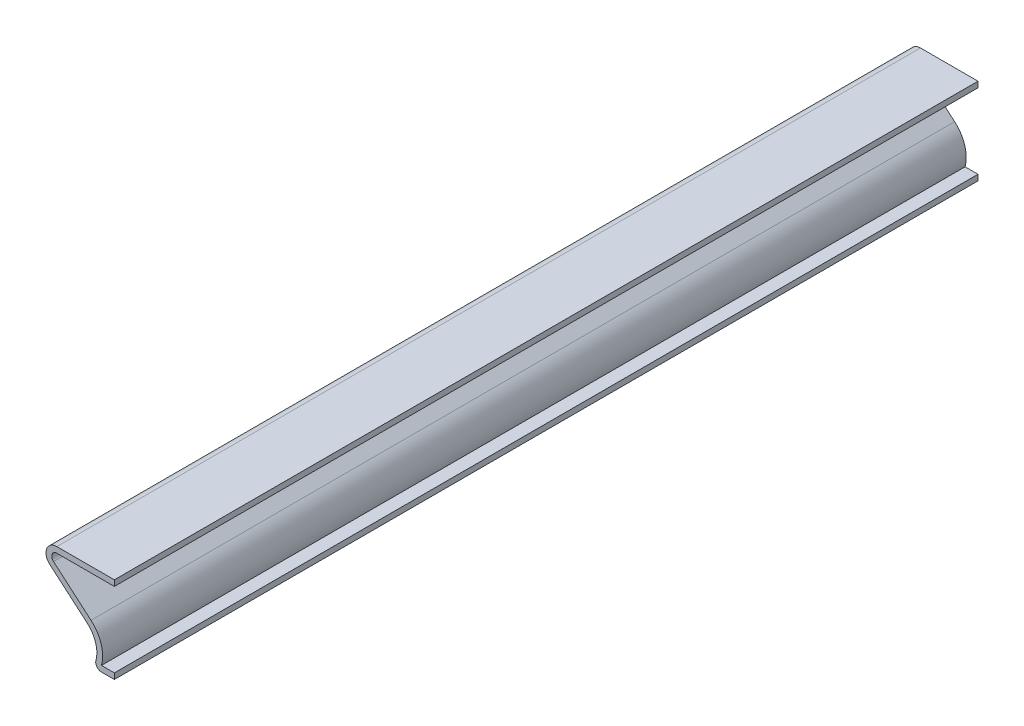
ISO-10303-21;
HEADER;
FILE_DESCRIPTION(('STEP AP214'),'2;1');
FILE_NAME('part.step','',(''),(''),'','','');
FILE_SCHEMA(('AUTOMOTIVE_DESIGN { 1 0 10303 214 1 1 1 1 }'));
ENDSEC;
DATA;
#1=APPLICATION_CONTEXT('core data for automotive mechanical design processes');
#2=APPLICATION_PROTOCOL_DEFINITION('international standard','automotive_design',2000,#1);
#3=PRODUCT_CONTEXT('',#1,'mechanical');
#4=PRODUCT('Part','Part','',(#3));
#5=PRODUCT_RELATED_PRODUCT_CATEGORY('part','',(#4));
#6=PRODUCT_DEFINITION_FORMATION('','',#4);
#7=PRODUCT_DEFINITION_CONTEXT('part definition',#1,'design');
#8=PRODUCT_DEFINITION('design','',#6,#7);
#9=PRODUCT_DEFINITION_SHAPE('','',#8);
#10=(LENGTH_UNIT() NAMED_UNIT(*) SI_UNIT(.MILLI.,.METRE.));
#11=(NAMED_UNIT(*) PLANE_ANGLE_UNIT() SI_UNIT($,.RADIAN.));
#12=(NAMED_UNIT(*) SI_UNIT($,.STERADIAN.) SOLID_ANGLE_UNIT());
#13=UNCERTAINTY_MEASURE_WITH_UNIT(LENGTH_MEASURE(1.E-05),#10,'distance_accuracy_value','');
#14=(GEOMETRIC_REPRESENTATION_CONTEXT(3) GLOBAL_UNCERTAINTY_ASSIGNED_CONTEXT((#13)) GLOBAL_UNIT_ASSIGNED_CONTEXT((#10,
#11,#12)) REPRESENTATION_CONTEXT('',''));
#15=CARTESIAN_POINT('',(0.,0.,0.));
#16=DIRECTION('',(0.,0.,1.));
#17=DIRECTION('',(1.,0.,0.));
#18=AXIS2_PLACEMENT_3D('',#15,#16,#17);
#19=CARTESIAN_POINT('',(-4.7625,0.,-190.5));
#20=DIRECTION('',(0.,-1.,0.));
#21=DIRECTION('',(0.,0.,-1.));
#22=AXIS2_PLACEMENT_3D('',#19,#20,#21);
#23=PLANE('',#22);
#24=DIRECTION('',(1.,0.,0.));
#25=VECTOR('',#24,1.);
#26=CARTESIAN_POINT('',(-4.7625,0.,0.));
#27=LINE('',#26,#25);
#28=CARTESIAN_POINT('',(-2.8457845091729,0.,0.));
#29=VERTEX_POINT('',#28);
#30=CARTESIAN_POINT('',(0.,0.,0.));
#31=VERTEX_POINT('',#30);
#32=EDGE_CURVE('E204',#29,#31,#27,.T.);
#33=ORIENTED_EDGE('',*,*,#32,.F.);
#34=DIRECTION('',(0.,0.,1.));
#35=VECTOR('',#34,1.);
#36=CARTESIAN_POINT('',(-2.8457845091729,0.,-190.5));
#37=LINE('',#36,#35);
#38=CARTESIAN_POINT('',(-2.8457845091729,0.,-190.5));
#39=VERTEX_POINT('',#38);
#40=EDGE_CURVE('E43',#29,#39,#37,.F.);
#41=ORIENTED_EDGE('',*,*,#40,.T.);
#42=DIRECTION('',(1.,0.,0.));
#43=VECTOR('',#42,1.);
#44=CARTESIAN_POINT('',(-4.7625,0.,-190.5));
#45=LINE('',#44,#43);
#46=CARTESIAN_POINT('',(0.,0.,-190.5));
#47=VERTEX_POINT('',#46);
#48=EDGE_CURVE('E126',#39,#47,#45,.T.);
#49=ORIENTED_EDGE('',*,*,#48,.T.);
#50=DIRECTION('',(0.,0.,1.));
#51=VECTOR('',#50,1.);
#52=CARTESIAN_POINT('',(0.,0.,-190.5));
#53=LINE('',#52,#51);
#54=EDGE_CURVE('E129',#47,#31,#53,.T.);
#55=ORIENTED_EDGE('',*,*,#54,.T.);
#56=EDGE_LOOP('',(#33,#41,#49,#55));
#57=FACE_BOUND('',#56,.T.);
#58=ADVANCED_FACE('F35',(#57),#23,.T.);
#59=CARTESIAN_POINT('',(-9.921875,3.175,-190.5));
#60=DIRECTION('',(0.,0.,1.));
#61=DIRECTION('',(1.,0.,0.));
#62=AXIS2_PLACEMENT_3D('',#59,#60,#61);
#63=CYLINDRICAL_SURFACE('',#62,6.05803395423177);
#64=CARTESIAN_POINT('',(-9.921875,3.175,-190.5));
#65=DIRECTION('',(0.,0.,-1.));
#66=DIRECTION('',(-1.,0.,0.));
#67=AXIS2_PLACEMENT_3D('',#64,#65,#66);
#68=CIRCLE('',#67,6.05803395423177);
#69=CARTESIAN_POINT('',(-5.9802225500164,7.77534252574341,-190.5));
#70=VERTEX_POINT('',#69);
#71=CARTESIAN_POINT('',(-4.0721209289381,1.60014994405189,-190.5));
#72=VERTEX_POINT('',#71);
#73=EDGE_CURVE('E148',#70,#72,#68,.T.);
#74=ORIENTED_EDGE('',*,*,#73,.T.);
#75=DIRECTION('',(0.,0.,1.));
#76=VECTOR('',#75,1.);
#77=CARTESIAN_POINT('',(-4.0721209289381,1.60014994405189,-190.5));
#78=LINE('',#77,#76);
#79=CARTESIAN_POINT('',(-4.0721209289381,1.60014994405189,0.));
#80=VERTEX_POINT('',#79);
#81=EDGE_CURVE('E157',#72,#80,#78,.T.);
#82=ORIENTED_EDGE('',*,*,#81,.T.);
#83=CARTESIAN_POINT('',(-9.921875,3.175,0.));
#84=DIRECTION('',(0.,0.,-1.));
#85=DIRECTION('',(-1.,0.,0.));
#86=AXIS2_PLACEMENT_3D('',#83,#84,#85);
#87=CIRCLE('',#86,6.05803395423177);
#88=CARTESIAN_POINT('',(-5.9802225500164,7.77534252574341,0.));
#89=VERTEX_POINT('',#88);
#90=EDGE_CURVE('E134',#89,#80,#87,.T.);
#91=ORIENTED_EDGE('',*,*,#90,.F.);
#92=DIRECTION('',(0.,0.,1.));
#93=VECTOR('',#92,1.);
#94=CARTESIAN_POINT('',(-5.9802225500164,7.77534252574341,-190.5));
#95=LINE('',#94,#93);
#96=EDGE_CURVE('E160',#70,#89,#95,.T.);
#97=ORIENTED_EDGE('',*,*,#96,.F.);
#98=EDGE_LOOP('',(#74,#82,#91,#97));
#99=FACE_BOUND('',#98,.T.);
#100=ADVANCED_FACE('F221',(#99),#63,.F.);
#101=CARTESIAN_POINT('',(-14.2493574264249,14.8604792438128,-190.5));
#102=DIRECTION('',(-0.650648787999976,-0.759378795249224,0.));
#103=DIRECTION('',(0.759378795249224,-0.650648787999976,0.));
#104=AXIS2_PLACEMENT_3D('',#101,#102,#103);
#105=PLANE('',#104);
#106=DIRECTION('',(0.759378795249224,-0.650648787999976,0.));
#107=VECTOR('',#106,1.);
#108=CARTESIAN_POINT('',(-14.2493574264249,14.8604792438128,0.));
#109=LINE('',#108,#107);
#110=CARTESIAN_POINT('',(-14.2493574264249,14.8604792438128,0.));
#111=VERTEX_POINT('',#110);
#112=EDGE_CURVE('E220',#111,#89,#109,.T.);
#113=ORIENTED_EDGE('',*,*,#112,.F.);
#114=DIRECTION('',(0.,0.,1.));
#115=VECTOR('',#114,1.);
#116=CARTESIAN_POINT('',(-14.2493574264249,14.8604792438128,-190.5));
#117=LINE('',#116,#115);
#118=CARTESIAN_POINT('',(-14.2493574264249,14.8604792438128,-190.5));
#119=VERTEX_POINT('',#118);
#120=EDGE_CURVE('E164',#119,#111,#117,.T.);
#121=ORIENTED_EDGE('',*,*,#120,.F.);
#122=DIRECTION('',(0.759378795249224,-0.650648787999976,0.));
#123=VECTOR('',#122,1.);
#124=CARTESIAN_POINT('',(-14.2493574264249,14.8604792438128,-190.5));
#125=LINE('',#124,#123);
#126=EDGE_CURVE('E153',#119,#70,#125,.T.);
#127=ORIENTED_EDGE('',*,*,#126,.T.);
#128=ORIENTED_EDGE('',*,*,#96,.T.);
#129=EDGE_LOOP('',(#113,#121,#127,#128));
#130=FACE_BOUND('',#129,.T.);
#131=ADVANCED_FACE('F224',(#130),#105,.T.);
#132=CARTESIAN_POINT('',(-12.7,16.66875,-190.5));
#133=DIRECTION('',(0.,0.,1.));
#134=DIRECTION('',(1.,0.,0.));
#135=AXIS2_PLACEMENT_3D('',#132,#133,#134);
#136=CYLINDRICAL_SURFACE('',#135,2.38125);
#137=CARTESIAN_POINT('',(-12.7,16.66875,0.));
#138=DIRECTION('',(0.,0.,1.));
#139=DIRECTION('',(1.,0.,0.));
#140=AXIS2_PLACEMENT_3D('',#137,#138,#139);
#141=CIRCLE('',#140,2.38125);
#142=CARTESIAN_POINT('',(-12.7,19.05,0.));
#143=VERTEX_POINT('',#142);
#144=EDGE_CURVE('E218',#143,#111,#141,.T.);
#145=ORIENTED_EDGE('',*,*,#144,.F.);
#146=DIRECTION('',(0.,0.,1.));
#147=VECTOR('',#146,1.);
#148=CARTESIAN_POINT('',(-12.7,19.05,-190.5));
#149=LINE('',#148,#147);
#150=CARTESIAN_POINT('',(-12.7,19.05,-190.5));
#151=VERTEX_POINT('',#150);
#152=EDGE_CURVE('E170',#151,#143,#149,.T.);
#153=ORIENTED_EDGE('',*,*,#152,.F.);
#154=CARTESIAN_POINT('',(-12.7,16.66875,-190.5));
#155=DIRECTION('',(0.,0.,1.));
#156=DIRECTION('',(1.,0.,0.));
#157=AXIS2_PLACEMENT_3D('',#154,#155,#156);
#158=CIRCLE('',#157,2.38125);
#159=EDGE_CURVE('E227',#151,#119,#158,.T.);
#160=ORIENTED_EDGE('',*,*,#159,.T.);
#161=ORIENTED_EDGE('',*,*,#120,.T.);
#162=EDGE_LOOP('',(#145,#153,#160,#161));
#163=FACE_BOUND('',#162,.T.);
#164=ADVANCED_FACE('F267',(#163),#136,.T.);
#165=CARTESIAN_POINT('',(0.,19.05,-190.5));
#166=DIRECTION('',(0.,1.,0.));
#167=DIRECTION('',(-1.,0.,0.));
#168=AXIS2_PLACEMENT_3D('',#165,#166,#167);
#169=PLANE('',#168);
#170=DIRECTION('',(-1.,0.,0.));
#171=VECTOR('',#170,1.);
#172=CARTESIAN_POINT('',(0.,19.05,0.));
#173=LINE('',#172,#171);
#174=CARTESIAN_POINT('',(0.,19.05,0.));
#175=VERTEX_POINT('',#174);
#176=EDGE_CURVE('E215',#175,#143,#173,.T.);
#177=ORIENTED_EDGE('',*,*,#176,.F.);
#178=DIRECTION('',(0.,0.,1.));
#179=VECTOR('',#178,1.);
#180=CARTESIAN_POINT('',(0.,19.05,-190.5));
#181=LINE('',#180,#179);
#182=CARTESIAN_POINT('',(0.,19.05,-190.5));
#183=VERTEX_POINT('',#182);
#184=EDGE_CURVE('E176',#183,#175,#181,.T.);
#185=ORIENTED_EDGE('',*,*,#184,.F.);
#186=DIRECTION('',(-1.,0.,0.));
#187=VECTOR('',#186,1.);
#188=CARTESIAN_POINT('',(0.,19.05,-190.5));
#189=LINE('',#188,#187);
#190=EDGE_CURVE('E370',#183,#151,#189,.T.);
#191=ORIENTED_EDGE('',*,*,#190,.T.);
#192=ORIENTED_EDGE('',*,*,#152,.T.);
#193=EDGE_LOOP('',(#177,#185,#191,#192));
#194=FACE_BOUND('',#193,.T.);
#195=ADVANCED_FACE('F263',(#194),#169,.T.);
#196=CARTESIAN_POINT('',(0.,19.05,-190.5));
#197=DIRECTION('',(-1.,0.,0.));
#198=DIRECTION('',(0.,-1.,0.));
#199=AXIS2_PLACEMENT_3D('',#196,#197,#198);
#200=PLANE('',#199);
#201=DIRECTION('',(0.,-1.,0.));
#202=VECTOR('',#201,1.);
#203=CARTESIAN_POINT('',(0.,19.05,0.));
#204=LINE('',#203,#202);
#205=CARTESIAN_POINT('',(0.,17.78,0.));
#206=VERTEX_POINT('',#205);
#207=EDGE_CURVE('E213',#175,#206,#204,.T.);
#208=ORIENTED_EDGE('',*,*,#207,.T.);
#209=DIRECTION('',(0.,0.,1.));
#210=VECTOR('',#209,1.);
#211=CARTESIAN_POINT('',(0.,17.78,-190.5));
#212=LINE('',#211,#210);
#213=CARTESIAN_POINT('',(0.,17.78,-190.5));
#214=VERTEX_POINT('',#213);
#215=EDGE_CURVE('E178',#214,#206,#212,.T.);
#216=ORIENTED_EDGE('',*,*,#215,.F.);
#217=DIRECTION('',(0.,-1.,0.));
#218=VECTOR('',#217,1.);
#219=CARTESIAN_POINT('',(0.,19.05,-190.5));
#220=LINE('',#219,#218);
#221=EDGE_CURVE('E371',#183,#214,#220,.T.);
#222=ORIENTED_EDGE('',*,*,#221,.F.);
#223=ORIENTED_EDGE('',*,*,#184,.T.);
#224=EDGE_LOOP('',(#208,#216,#222,#223));
#225=FACE_BOUND('',#224,.T.);
#226=ADVANCED_FACE('F259',(#225),#200,.F.);
#227=CARTESIAN_POINT('',(0.,17.78,-190.5));
#228=DIRECTION('',(0.,1.,0.));
#229=DIRECTION('',(-1.,0.,0.));
#230=AXIS2_PLACEMENT_3D('',#227,#228,#229);
#231=PLANE('',#230);
#232=DIRECTION('',(-1.,0.,0.));
#233=VECTOR('',#232,1.);
#234=CARTESIAN_POINT('',(0.,17.78,0.));
#235=LINE('',#234,#233);
#236=CARTESIAN_POINT('',(-12.7,17.78,0.));
#237=VERTEX_POINT('',#236);
#238=EDGE_CURVE('E211',#206,#237,#235,.T.);
#239=ORIENTED_EDGE('',*,*,#238,.T.);
#240=DIRECTION('',(0.,0.,1.));
#241=VECTOR('',#240,1.);
#242=CARTESIAN_POINT('',(-12.7,17.78,-190.5));
#243=LINE('',#242,#241);
#244=CARTESIAN_POINT('',(-12.7,17.78,-190.5));
#245=VERTEX_POINT('',#244);
#246=EDGE_CURVE('E181',#245,#237,#243,.T.);
#247=ORIENTED_EDGE('',*,*,#246,.F.);
#248=DIRECTION('',(-1.,0.,0.));
#249=VECTOR('',#248,1.);
#250=CARTESIAN_POINT('',(0.,17.78,-190.5));
#251=LINE('',#250,#249);
#252=EDGE_CURVE('E374',#214,#245,#251,.T.);
#253=ORIENTED_EDGE('',*,*,#252,.F.);
#254=ORIENTED_EDGE('',*,*,#215,.T.);
#255=EDGE_LOOP('',(#239,#247,#253,#254));
#256=FACE_BOUND('',#255,.T.);
#257=ADVANCED_FACE('F255',(#256),#231,.F.);
#258=CARTESIAN_POINT('',(-12.7,16.66875,-190.5));
#259=DIRECTION('',(0.,0.,1.));
#260=DIRECTION('',(1.,0.,0.));
#261=AXIS2_PLACEMENT_3D('',#258,#259,#260);
#262=CYLINDRICAL_SURFACE('',#261,1.11125);
#263=CARTESIAN_POINT('',(-12.7,16.66875,0.));
#264=DIRECTION('',(0.,0.,1.));
#265=DIRECTION('',(1.,0.,0.));
#266=AXIS2_PLACEMENT_3D('',#263,#264,#265);
#267=CIRCLE('',#266,1.11125);
#268=CARTESIAN_POINT('',(-13.423033465665,15.8248903137793,0.));
#269=VERTEX_POINT('',#268);
#270=EDGE_CURVE('E209',#237,#269,#267,.T.);
#271=ORIENTED_EDGE('',*,*,#270,.T.);
#272=DIRECTION('',(0.,0.,1.));
#273=VECTOR('',#272,1.);
#274=CARTESIAN_POINT('',(-13.423033465665,15.8248903137793,-190.5));
#275=LINE('',#274,#273);
#276=CARTESIAN_POINT('',(-13.423033465665,15.8248903137793,-190.5));
#277=VERTEX_POINT('',#276);
#278=EDGE_CURVE('E184',#277,#269,#275,.T.);
#279=ORIENTED_EDGE('',*,*,#278,.F.);
#280=CARTESIAN_POINT('',(-12.7,16.66875,-190.5));
#281=DIRECTION('',(0.,0.,1.));
#282=DIRECTION('',(1.,0.,0.));
#283=AXIS2_PLACEMENT_3D('',#280,#281,#282);
#284=CIRCLE('',#283,1.11125);
#285=EDGE_CURVE('E378',#245,#277,#284,.T.);
#286=ORIENTED_EDGE('',*,*,#285,.F.);
#287=ORIENTED_EDGE('',*,*,#246,.T.);
#288=EDGE_LOOP('',(#271,#279,#286,#287));
#289=FACE_BOUND('',#288,.T.);
#290=ADVANCED_FACE('F251',(#289),#262,.F.);
#291=CARTESIAN_POINT('',(-13.423033465665,15.8248903137793,-190.5));
#292=DIRECTION('',(-0.650648787999976,-0.759378795249224,0.));
#293=DIRECTION('',(0.759378795249224,-0.650648787999976,0.));
#294=AXIS2_PLACEMENT_3D('',#291,#292,#293);
#295=PLANE('',#294);
#296=DIRECTION('',(0.759378795249224,-0.650648787999976,0.));
#297=VECTOR('',#296,1.);
#298=CARTESIAN_POINT('',(-13.423033465665,15.8248903137793,0.));
#299=LINE('',#298,#297);
#300=CARTESIAN_POINT('',(-5.15389858925643,8.73975359570993,0.));
#301=VERTEX_POINT('',#300);
#302=EDGE_CURVE('E202',#269,#301,#299,.T.);
#303=ORIENTED_EDGE('',*,*,#302,.T.);
#304=DIRECTION('',(0.,0.,1.));
#305=VECTOR('',#304,1.);
#306=CARTESIAN_POINT('',(-5.15389858925643,8.73975359570993,-190.5));
#307=LINE('',#306,#305);
#308=CARTESIAN_POINT('',(-5.15389858925643,8.73975359570993,-190.5));
#309=VERTEX_POINT('',#308);
#310=EDGE_CURVE('E187',#309,#301,#307,.T.);
#311=ORIENTED_EDGE('',*,*,#310,.F.);
#312=DIRECTION('',(0.759378795249224,-0.650648787999976,0.));
#313=VECTOR('',#312,1.);
#314=CARTESIAN_POINT('',(-13.423033465665,15.8248903137793,-190.5));
#315=LINE('',#314,#313);
#316=EDGE_CURVE('E380',#277,#309,#315,.T.);
#317=ORIENTED_EDGE('',*,*,#316,.F.);
#318=ORIENTED_EDGE('',*,*,#278,.T.);
#319=EDGE_LOOP('',(#303,#311,#317,#318));
#320=FACE_BOUND('',#319,.T.);
#321=ADVANCED_FACE('F248',(#320),#295,.F.);
#322=CARTESIAN_POINT('',(-9.921875,3.175,-190.5));
#323=DIRECTION('',(0.,0.,1.));
#324=DIRECTION('',(1.,0.,0.));
#325=AXIS2_PLACEMENT_3D('',#322,#323,#324);
#326=CYLINDRICAL_SURFACE('',#325,7.32803395423177);
#327=CARTESIAN_POINT('',(-9.921875,3.175,0.));
#328=DIRECTION('',(0.,0.,1.));
#329=DIRECTION('',(1.,0.,0.));
#330=AXIS2_PLACEMENT_3D('',#327,#328,#329);
#331=CIRCLE('',#330,7.32803395423177);
#332=CARTESIAN_POINT('',(-2.8457845091729,1.27,0.));
#333=VERTEX_POINT('',#332);
#334=EDGE_CURVE('E200',#301,#333,#331,.F.);
#335=ORIENTED_EDGE('',*,*,#334,.T.);
#336=DIRECTION('',(0.,0.,1.));
#337=VECTOR('',#336,1.);
#338=CARTESIAN_POINT('',(-2.8457845091729,1.27,-190.5));
#339=LINE('',#338,#337);
#340=CARTESIAN_POINT('',(-2.8457845091729,1.27,-190.5));
#341=VERTEX_POINT('',#340);
#342=EDGE_CURVE('E150',#341,#333,#339,.T.);
#343=ORIENTED_EDGE('',*,*,#342,.F.);
#344=CARTESIAN_POINT('',(-9.921875,3.175,-190.5));
#345=DIRECTION('',(0.,0.,1.));
#346=DIRECTION('',(1.,0.,0.));
#347=AXIS2_PLACEMENT_3D('',#344,#345,#346);
#348=CIRCLE('',#347,7.32803395423177);
#349=EDGE_CURVE('E382',#309,#341,#348,.F.);
#350=ORIENTED_EDGE('',*,*,#349,.F.);
#351=ORIENTED_EDGE('',*,*,#310,.T.);
#352=EDGE_LOOP('',(#335,#343,#350,#351));
#353=FACE_BOUND('',#352,.T.);
#354=ADVANCED_FACE('F245',(#353),#326,.T.);
#355=CARTESIAN_POINT('',(-4.7625,1.27,-190.5));
#356=DIRECTION('',(0.,-1.,0.));
#357=DIRECTION('',(0.,0.,-1.));
#358=AXIS2_PLACEMENT_3D('',#355,#356,#357);
#359=PLANE('',#358);
#360=DIRECTION('',(1.,0.,0.));
#361=VECTOR('',#360,1.);
#362=CARTESIAN_POINT('',(-4.7625,1.27,0.));
#363=LINE('',#362,#361);
#364=CARTESIAN_POINT('',(0.,1.27,0.));
#365=VERTEX_POINT('',#364);
#366=EDGE_CURVE('E194',#333,#365,#363,.T.);
#367=ORIENTED_EDGE('',*,*,#366,.T.);
#368=DIRECTION('',(0.,0.,1.));
#369=VECTOR('',#368,1.);
#370=CARTESIAN_POINT('',(0.,1.27,-190.5));
#371=LINE('',#370,#369);
#372=CARTESIAN_POINT('',(0.,1.27,-190.5));
#373=VERTEX_POINT('',#372);
#374=EDGE_CURVE('E147',#373,#365,#371,.T.);
#375=ORIENTED_EDGE('',*,*,#374,.F.);
#376=DIRECTION('',(1.,0.,0.));
#377=VECTOR('',#376,1.);
#378=CARTESIAN_POINT('',(-4.7625,1.27,-190.5));
#379=LINE('',#378,#377);
#380=EDGE_CURVE('E139',#341,#373,#379,.T.);
#381=ORIENTED_EDGE('',*,*,#380,.F.);
#382=ORIENTED_EDGE('',*,*,#342,.T.);
#383=EDGE_LOOP('',(#367,#375,#381,#382));
#384=FACE_BOUND('',#383,.T.);
#385=ADVANCED_FACE('F193',(#384),#359,.F.);
#386=CARTESIAN_POINT('',(0.,1.27,-190.5));
#387=DIRECTION('',(-1.,0.,0.));
#388=DIRECTION('',(0.,0.,1.));
#389=AXIS2_PLACEMENT_3D('',#386,#387,#388);
#390=PLANE('',#389);
#391=DIRECTION('',(0.,-1.,0.));
#392=VECTOR('',#391,1.);
#393=CARTESIAN_POINT('',(0.,1.27,0.));
#394=LINE('',#393,#392);
#395=EDGE_CURVE('E146',#365,#31,#394,.T.);
#396=ORIENTED_EDGE('',*,*,#395,.T.);
#397=ORIENTED_EDGE('',*,*,#54,.F.);
#398=DIRECTION('',(0.,-1.,0.));
#399=VECTOR('',#398,1.);
#400=CARTESIAN_POINT('',(0.,1.27,-190.5));
#401=LINE('',#400,#399);
#402=EDGE_CURVE('E133',#373,#47,#401,.T.);
#403=ORIENTED_EDGE('',*,*,#402,.F.);
#404=ORIENTED_EDGE('',*,*,#374,.T.);
#405=EDGE_LOOP('',(#396,#397,#403,#404));
#406=FACE_BOUND('',#405,.T.);
#407=ADVANCED_FACE('F144',(#406),#390,.F.);
#408=CARTESIAN_POINT('',(-9.921875,3.175,-190.5));
#409=DIRECTION('',(0.,0.,1.));
#410=DIRECTION('',(1.,0.,0.));
#411=AXIS2_PLACEMENT_3D('',#408,#409,#410);
#412=PLANE('',#411);
#413=ORIENTED_EDGE('',*,*,#48,.F.);
#414=CARTESIAN_POINT('',(-2.8457845091729,1.27,-190.5));
#415=DIRECTION('',(0.,0.,1.));
#416=DIRECTION('',(1.,0.,0.));
#417=AXIS2_PLACEMENT_3D('',#414,#415,#416);
#418=CIRCLE('',#417,1.27);
#419=EDGE_CURVE('E11',#39,#72,#418,.F.);
#420=ORIENTED_EDGE('',*,*,#419,.T.);
#421=ORIENTED_EDGE('',*,*,#73,.F.);
#422=ORIENTED_EDGE('',*,*,#126,.F.);
#423=ORIENTED_EDGE('',*,*,#159,.F.);
#424=ORIENTED_EDGE('',*,*,#190,.F.);
#425=ORIENTED_EDGE('',*,*,#221,.T.);
#426=ORIENTED_EDGE('',*,*,#252,.T.);
#427=ORIENTED_EDGE('',*,*,#285,.T.);
#428=ORIENTED_EDGE('',*,*,#316,.T.);
#429=ORIENTED_EDGE('',*,*,#349,.T.);
#430=ORIENTED_EDGE('',*,*,#380,.T.);
#431=ORIENTED_EDGE('',*,*,#402,.T.);
#432=EDGE_LOOP('',(#413,#420,#421,#422,#423,#424,#425,#426,#427,#428,#429,#430,#431));
#433=FACE_BOUND('',#432,.T.);
#434=ADVANCED_FACE('F137',(#433),#412,.F.);
#435=CARTESIAN_POINT('',(-9.921875,3.175,0.));
#436=DIRECTION('',(0.,0.,1.));
#437=DIRECTION('',(1.,0.,0.));
#438=AXIS2_PLACEMENT_3D('',#435,#436,#437);
#439=PLANE('',#438);
#440=ORIENTED_EDGE('',*,*,#90,.T.);
#441=CARTESIAN_POINT('',(-2.8457845091729,1.27,0.));
#442=DIRECTION('',(0.,0.,1.));
#443=DIRECTION('',(1.,0.,0.));
#444=AXIS2_PLACEMENT_3D('',#441,#442,#443);
#445=CIRCLE('',#444,1.27);
#446=EDGE_CURVE('E57',#80,#29,#445,.T.);
#447=ORIENTED_EDGE('',*,*,#446,.T.);
#448=ORIENTED_EDGE('',*,*,#32,.T.);
#449=ORIENTED_EDGE('',*,*,#395,.F.);
#450=ORIENTED_EDGE('',*,*,#366,.F.);
#451=ORIENTED_EDGE('',*,*,#334,.F.);
#452=ORIENTED_EDGE('',*,*,#302,.F.);
#453=ORIENTED_EDGE('',*,*,#270,.F.);
#454=ORIENTED_EDGE('',*,*,#238,.F.);
#455=ORIENTED_EDGE('',*,*,#207,.F.);
#456=ORIENTED_EDGE('',*,*,#176,.T.);
#457=ORIENTED_EDGE('',*,*,#144,.T.);
#458=ORIENTED_EDGE('',*,*,#112,.T.);
#459=EDGE_LOOP('',(#440,#447,#448,#449,#450,#451,#452,#453,#454,#455,#456,#457,#458));
#460=FACE_BOUND('',#459,.T.);
#461=ADVANCED_FACE('F198',(#460),#439,.T.);
#462=CARTESIAN_POINT('',(-2.8457845091729,1.27,-190.5));
#463=DIRECTION('',(0.,0.,1.));
#464=DIRECTION('',(1.,0.,0.));
#465=AXIS2_PLACEMENT_3D('',#462,#463,#464);
#466=CYLINDRICAL_SURFACE('',#465,1.27);
#467=ORIENTED_EDGE('',*,*,#419,.F.);
#468=ORIENTED_EDGE('',*,*,#40,.F.);
#469=ORIENTED_EDGE('',*,*,#446,.F.);
#470=ORIENTED_EDGE('',*,*,#81,.F.);
#471=EDGE_LOOP('',(#467,#468,#469,#470));
#472=FACE_BOUND('',#471,.T.);
#473=ADVANCED_FACE('F37',(#472),#466,.T.);
#474=CLOSED_SHELL('',(#58,#100,#131,#164,#195,#226,#257,#290,#321,#354,#385,#407,#434,#461,#473));
#475=MANIFOLD_SOLID_BREP('B2',#474);
#476=ADVANCED_BREP_SHAPE_REPRESENTATION('',(#18,#475),#14);
#477=SHAPE_DEFINITION_REPRESENTATION(#9,#476);
ENDSEC;
END-ISO-10303-21;
